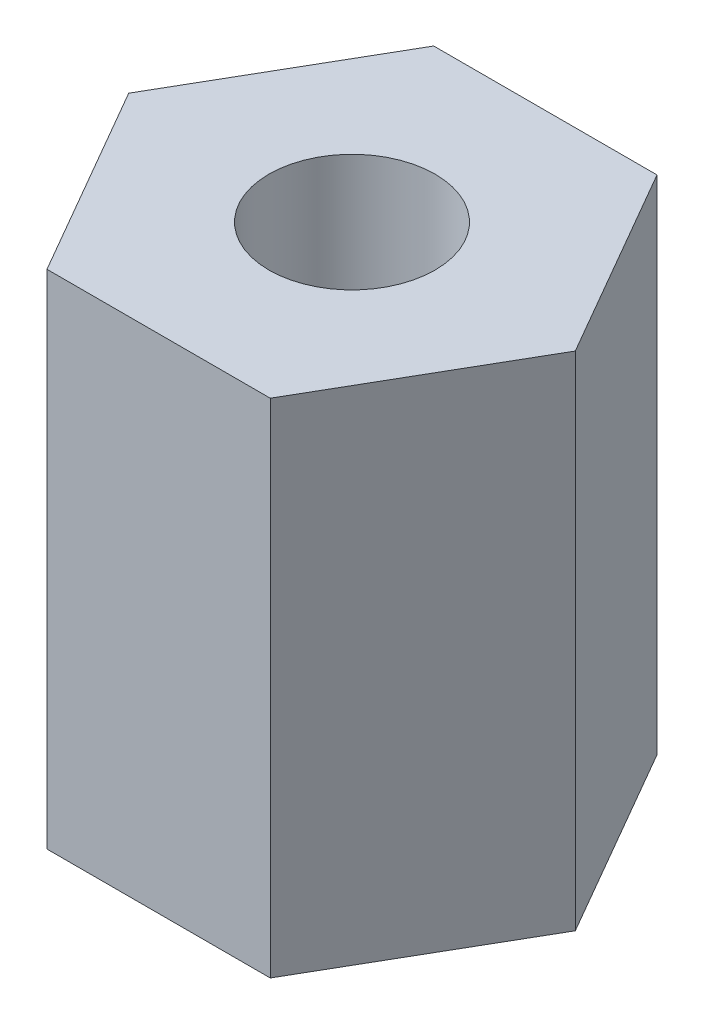
ISO-10303-21;
HEADER;
FILE_DESCRIPTION(('STEP AP214'),'2;1');
FILE_NAME('part.step','',(''),(''),'','','');
FILE_SCHEMA(('AUTOMOTIVE_DESIGN { 1 0 10303 214 1 1 1 1 }'));
ENDSEC;
DATA;
#1=APPLICATION_CONTEXT('core data for automotive mechanical design processes');
#2=APPLICATION_PROTOCOL_DEFINITION('international standard','automotive_design',2000,#1);
#3=PRODUCT_CONTEXT('',#1,'mechanical');
#4=PRODUCT('Part','Part','',(#3));
#5=PRODUCT_RELATED_PRODUCT_CATEGORY('part','',(#4));
#6=PRODUCT_DEFINITION_FORMATION('','',#4);
#7=PRODUCT_DEFINITION_CONTEXT('part definition',#1,'design');
#8=PRODUCT_DEFINITION('design','',#6,#7);
#9=PRODUCT_DEFINITION_SHAPE('','',#8);
#10=(LENGTH_UNIT() NAMED_UNIT(*) SI_UNIT(.MILLI.,.METRE.));
#11=(NAMED_UNIT(*) PLANE_ANGLE_UNIT() SI_UNIT($,.RADIAN.));
#12=(NAMED_UNIT(*) SI_UNIT($,.STERADIAN.) SOLID_ANGLE_UNIT());
#13=UNCERTAINTY_MEASURE_WITH_UNIT(LENGTH_MEASURE(1.E-05),#10,'distance_accuracy_value','');
#14=(GEOMETRIC_REPRESENTATION_CONTEXT(3) GLOBAL_UNCERTAINTY_ASSIGNED_CONTEXT((#13)) GLOBAL_UNIT_ASSIGNED_CONTEXT((#10,
#11,#12)) REPRESENTATION_CONTEXT('',''));
#15=CARTESIAN_POINT('',(0.,0.,0.));
#16=DIRECTION('',(0.,0.,1.));
#17=DIRECTION('',(1.,0.,0.));
#18=AXIS2_PLACEMENT_3D('',#15,#16,#17);
#19=CARTESIAN_POINT('',(1.4675,6.6,-2.54178456010733));
#20=DIRECTION('',(0.,0.,1.));
#21=DIRECTION('',(1.,0.,0.));
#22=AXIS2_PLACEMENT_3D('',#19,#20,#21);
#23=PLANE('',#22);
#24=DIRECTION('',(-1.,0.,0.));
#25=VECTOR('',#24,1.);
#26=CARTESIAN_POINT('',(1.4675,0.,-2.54178456010733));
#27=LINE('',#26,#25);
#28=CARTESIAN_POINT('',(1.4675,0.,-2.54178456010733));
#29=VERTEX_POINT('',#28);
#30=CARTESIAN_POINT('',(-1.4675,0.,-2.54178456010733));
#31=VERTEX_POINT('',#30);
#32=EDGE_CURVE('E130',#29,#31,#27,.T.);
#33=ORIENTED_EDGE('',*,*,#32,.T.);
#34=DIRECTION('',(0.,-1.,0.));
#35=VECTOR('',#34,1.);
#36=CARTESIAN_POINT('',(-1.4675,6.6,-2.54178456010733));
#37=LINE('',#36,#35);
#38=CARTESIAN_POINT('',(-1.4675,6.6,-2.54178456010733));
#39=VERTEX_POINT('',#38);
#40=EDGE_CURVE('E11',#39,#31,#37,.T.);
#41=ORIENTED_EDGE('',*,*,#40,.F.);
#42=DIRECTION('',(-1.,0.,0.));
#43=VECTOR('',#42,1.);
#44=CARTESIAN_POINT('',(1.4675,6.6,-2.54178456010733));
#45=LINE('',#44,#43);
#46=CARTESIAN_POINT('',(1.4675,6.6,-2.54178456010733));
#47=VERTEX_POINT('',#46);
#48=EDGE_CURVE('E147',#47,#39,#45,.T.);
#49=ORIENTED_EDGE('',*,*,#48,.F.);
#50=DIRECTION('',(0.,-1.,0.));
#51=VECTOR('',#50,1.);
#52=CARTESIAN_POINT('',(1.4675,6.6,-2.54178456010733));
#53=LINE('',#52,#51);
#54=EDGE_CURVE('E126',#47,#29,#53,.T.);
#55=ORIENTED_EDGE('',*,*,#54,.T.);
#56=EDGE_LOOP('',(#33,#41,#49,#55));
#57=FACE_BOUND('',#56,.T.);
#58=ADVANCED_FACE('F41',(#57),#23,.F.);
#59=CARTESIAN_POINT('',(-1.4675,6.6,-2.54178456010733));
#60=DIRECTION('',(0.866025403784439,0.,0.5));
#61=DIRECTION('',(0.5,0.,-0.866025403784439));
#62=AXIS2_PLACEMENT_3D('',#59,#60,#61);
#63=PLANE('',#62);
#64=DIRECTION('',(-0.5,0.,0.866025403784439));
#65=VECTOR('',#64,1.);
#66=CARTESIAN_POINT('',(-1.4675,0.,-2.54178456010733));
#67=LINE('',#66,#65);
#68=CARTESIAN_POINT('',(-2.935,0.,0.));
#69=VERTEX_POINT('',#68);
#70=EDGE_CURVE('E134',#31,#69,#67,.T.);
#71=ORIENTED_EDGE('',*,*,#70,.T.);
#72=DIRECTION('',(0.,-1.,0.));
#73=VECTOR('',#72,1.);
#74=CARTESIAN_POINT('',(-2.935,6.6,0.));
#75=LINE('',#74,#73);
#76=CARTESIAN_POINT('',(-2.935,6.6,0.));
#77=VERTEX_POINT('',#76);
#78=EDGE_CURVE('E50',#77,#69,#75,.T.);
#79=ORIENTED_EDGE('',*,*,#78,.F.);
#80=DIRECTION('',(-0.5,0.,0.866025403784439));
#81=VECTOR('',#80,1.);
#82=CARTESIAN_POINT('',(-1.4675,6.6,-2.54178456010733));
#83=LINE('',#82,#81);
#84=EDGE_CURVE('E95',#39,#77,#83,.T.);
#85=ORIENTED_EDGE('',*,*,#84,.F.);
#86=ORIENTED_EDGE('',*,*,#40,.T.);
#87=EDGE_LOOP('',(#71,#79,#85,#86));
#88=FACE_BOUND('',#87,.T.);
#89=ADVANCED_FACE('F176',(#88),#63,.F.);
#90=CARTESIAN_POINT('',(-2.935,6.6,0.));
#91=DIRECTION('',(0.866025403784439,0.,-0.5));
#92=DIRECTION('',(-0.5,0.,-0.866025403784439));
#93=AXIS2_PLACEMENT_3D('',#90,#91,#92);
#94=PLANE('',#93);
#95=DIRECTION('',(0.5,0.,0.866025403784439));
#96=VECTOR('',#95,1.);
#97=CARTESIAN_POINT('',(-2.935,0.,0.));
#98=LINE('',#97,#96);
#99=CARTESIAN_POINT('',(-1.4675,0.,2.54178456010733));
#100=VERTEX_POINT('',#99);
#101=EDGE_CURVE('E138',#69,#100,#98,.T.);
#102=ORIENTED_EDGE('',*,*,#101,.T.);
#103=DIRECTION('',(0.,-1.,0.));
#104=VECTOR('',#103,1.);
#105=CARTESIAN_POINT('',(-1.4675,6.6,2.54178456010733));
#106=LINE('',#105,#104);
#107=CARTESIAN_POINT('',(-1.4675,6.6,2.54178456010733));
#108=VERTEX_POINT('',#107);
#109=EDGE_CURVE('E119',#108,#100,#106,.T.);
#110=ORIENTED_EDGE('',*,*,#109,.F.);
#111=DIRECTION('',(0.5,0.,0.866025403784439));
#112=VECTOR('',#111,1.);
#113=CARTESIAN_POINT('',(-2.935,6.6,0.));
#114=LINE('',#113,#112);
#115=EDGE_CURVE('E108',#77,#108,#114,.T.);
#116=ORIENTED_EDGE('',*,*,#115,.F.);
#117=ORIENTED_EDGE('',*,*,#78,.T.);
#118=EDGE_LOOP('',(#102,#110,#116,#117));
#119=FACE_BOUND('',#118,.T.);
#120=ADVANCED_FACE('F157',(#119),#94,.F.);
#121=CARTESIAN_POINT('',(-1.4675,6.6,2.54178456010733));
#122=DIRECTION('',(0.,0.,-1.));
#123=DIRECTION('',(-1.,0.,0.));
#124=AXIS2_PLACEMENT_3D('',#121,#122,#123);
#125=PLANE('',#124);
#126=DIRECTION('',(1.,0.,0.));
#127=VECTOR('',#126,1.);
#128=CARTESIAN_POINT('',(-1.4675,0.,2.54178456010733));
#129=LINE('',#128,#127);
#130=CARTESIAN_POINT('',(1.4675,0.,2.54178456010733));
#131=VERTEX_POINT('',#130);
#132=EDGE_CURVE('E117',#100,#131,#129,.T.);
#133=ORIENTED_EDGE('',*,*,#132,.T.);
#134=DIRECTION('',(0.,-1.,0.));
#135=VECTOR('',#134,1.);
#136=CARTESIAN_POINT('',(1.4675,6.6,2.54178456010733));
#137=LINE('',#136,#135);
#138=CARTESIAN_POINT('',(1.4675,6.6,2.54178456010733));
#139=VERTEX_POINT('',#138);
#140=EDGE_CURVE('E114',#139,#131,#137,.T.);
#141=ORIENTED_EDGE('',*,*,#140,.F.);
#142=DIRECTION('',(1.,0.,0.));
#143=VECTOR('',#142,1.);
#144=CARTESIAN_POINT('',(-1.4675,6.6,2.54178456010733));
#145=LINE('',#144,#143);
#146=EDGE_CURVE('E102',#108,#139,#145,.T.);
#147=ORIENTED_EDGE('',*,*,#146,.F.);
#148=ORIENTED_EDGE('',*,*,#109,.T.);
#149=EDGE_LOOP('',(#133,#141,#147,#148));
#150=FACE_BOUND('',#149,.T.);
#151=ADVANCED_FACE('F115',(#150),#125,.F.);
#152=CARTESIAN_POINT('',(1.4675,6.6,2.54178456010733));
#153=DIRECTION('',(-0.866025403784439,0.,-0.5));
#154=DIRECTION('',(-0.5,0.,0.866025403784439));
#155=AXIS2_PLACEMENT_3D('',#152,#153,#154);
#156=PLANE('',#155);
#157=DIRECTION('',(0.5,0.,-0.866025403784439));
#158=VECTOR('',#157,1.);
#159=CARTESIAN_POINT('',(1.4675,0.,2.54178456010733));
#160=LINE('',#159,#158);
#161=CARTESIAN_POINT('',(2.935,0.,0.));
#162=VERTEX_POINT('',#161);
#163=EDGE_CURVE('E81',#131,#162,#160,.T.);
#164=ORIENTED_EDGE('',*,*,#163,.T.);
#165=DIRECTION('',(0.,-1.,0.));
#166=VECTOR('',#165,1.);
#167=CARTESIAN_POINT('',(2.935,6.6,0.));
#168=LINE('',#167,#166);
#169=CARTESIAN_POINT('',(2.935,6.6,0.));
#170=VERTEX_POINT('',#169);
#171=EDGE_CURVE('E120',#170,#162,#168,.T.);
#172=ORIENTED_EDGE('',*,*,#171,.F.);
#173=DIRECTION('',(0.5,0.,-0.866025403784439));
#174=VECTOR('',#173,1.);
#175=CARTESIAN_POINT('',(1.4675,6.6,2.54178456010733));
#176=LINE('',#175,#174);
#177=EDGE_CURVE('E106',#139,#170,#176,.T.);
#178=ORIENTED_EDGE('',*,*,#177,.F.);
#179=ORIENTED_EDGE('',*,*,#140,.T.);
#180=EDGE_LOOP('',(#164,#172,#178,#179));
#181=FACE_BOUND('',#180,.T.);
#182=ADVANCED_FACE('F122',(#181),#156,.F.);
#183=CARTESIAN_POINT('',(2.935,6.6,0.));
#184=DIRECTION('',(-0.866025403784439,0.,0.5));
#185=DIRECTION('',(0.5,0.,0.866025403784439));
#186=AXIS2_PLACEMENT_3D('',#183,#184,#185);
#187=PLANE('',#186);
#188=DIRECTION('',(-0.5,0.,-0.866025403784439));
#189=VECTOR('',#188,1.);
#190=CARTESIAN_POINT('',(2.935,0.,0.));
#191=LINE('',#190,#189);
#192=EDGE_CURVE('E87',#162,#29,#191,.T.);
#193=ORIENTED_EDGE('',*,*,#192,.T.);
#194=ORIENTED_EDGE('',*,*,#54,.F.);
#195=DIRECTION('',(-0.5,0.,-0.866025403784439));
#196=VECTOR('',#195,1.);
#197=CARTESIAN_POINT('',(2.935,6.6,0.));
#198=LINE('',#197,#196);
#199=EDGE_CURVE('E58',#170,#47,#198,.T.);
#200=ORIENTED_EDGE('',*,*,#199,.F.);
#201=ORIENTED_EDGE('',*,*,#171,.T.);
#202=EDGE_LOOP('',(#193,#194,#200,#201));
#203=FACE_BOUND('',#202,.T.);
#204=ADVANCED_FACE('F164',(#203),#187,.F.);
#205=CARTESIAN_POINT('',(0.,6.6,0.));
#206=DIRECTION('',(0.,1.,0.));
#207=DIRECTION('',(0.,0.,1.));
#208=AXIS2_PLACEMENT_3D('',#205,#206,#207);
#209=PLANE('',#208);
#210=CARTESIAN_POINT('',(0.,6.6,0.));
#211=DIRECTION('',(0.,-1.,0.));
#212=DIRECTION('',(0.,0.,-1.));
#213=AXIS2_PLACEMENT_3D('',#210,#211,#212);
#214=CIRCLE('',#213,1.0922);
#215=CARTESIAN_POINT('',(0.,6.6,-1.0922));
#216=VERTEX_POINT('',#215);
#217=EDGE_CURVE('E135',#216,#216,#214,.T.);
#218=ORIENTED_EDGE('',*,*,#217,.T.);
#219=EDGE_LOOP('',(#218));
#220=FACE_BOUND('',#219,.T.);
#221=ORIENTED_EDGE('',*,*,#48,.T.);
#222=ORIENTED_EDGE('',*,*,#84,.T.);
#223=ORIENTED_EDGE('',*,*,#115,.T.);
#224=ORIENTED_EDGE('',*,*,#146,.T.);
#225=ORIENTED_EDGE('',*,*,#177,.T.);
#226=ORIENTED_EDGE('',*,*,#199,.T.);
#227=EDGE_LOOP('',(#221,#222,#223,#224,#225,#226));
#228=FACE_BOUND('',#227,.T.);
#229=ADVANCED_FACE('F104',(#220,#228),#209,.T.);
#230=CARTESIAN_POINT('',(0.,0.,0.));
#231=DIRECTION('',(0.,1.,0.));
#232=DIRECTION('',(0.,0.,1.));
#233=AXIS2_PLACEMENT_3D('',#230,#231,#232);
#234=PLANE('',#233);
#235=CARTESIAN_POINT('',(0.,0.,0.));
#236=DIRECTION('',(0.,-1.,0.));
#237=DIRECTION('',(0.,0.,-1.));
#238=AXIS2_PLACEMENT_3D('',#235,#236,#237);
#239=CIRCLE('',#238,1.0922);
#240=CARTESIAN_POINT('',(0.,0.,-1.0922));
#241=VERTEX_POINT('',#240);
#242=EDGE_CURVE('E250',#241,#241,#239,.T.);
#243=ORIENTED_EDGE('',*,*,#242,.F.);
#244=EDGE_LOOP('',(#243));
#245=FACE_BOUND('',#244,.T.);
#246=ORIENTED_EDGE('',*,*,#32,.F.);
#247=ORIENTED_EDGE('',*,*,#192,.F.);
#248=ORIENTED_EDGE('',*,*,#163,.F.);
#249=ORIENTED_EDGE('',*,*,#132,.F.);
#250=ORIENTED_EDGE('',*,*,#101,.F.);
#251=ORIENTED_EDGE('',*,*,#70,.F.);
#252=EDGE_LOOP('',(#246,#247,#248,#249,#250,#251));
#253=FACE_BOUND('',#252,.T.);
#254=ADVANCED_FACE('F160',(#245,#253),#234,.F.);
#255=CARTESIAN_POINT('',(0.,6.6,0.));
#256=DIRECTION('',(0.,-1.,0.));
#257=DIRECTION('',(0.,0.,-1.));
#258=AXIS2_PLACEMENT_3D('',#255,#256,#257);
#259=CYLINDRICAL_SURFACE('',#258,1.0922);
#260=ORIENTED_EDGE('',*,*,#217,.F.);
#261=EDGE_LOOP('',(#260));
#262=FACE_BOUND('',#261,.T.);
#263=ORIENTED_EDGE('',*,*,#242,.T.);
#264=EDGE_LOOP('',(#263));
#265=FACE_BOUND('',#264,.T.);
#266=ADVANCED_FACE('F216',(#262,#265),#259,.F.);
#267=CLOSED_SHELL('',(#58,#89,#120,#151,#182,#204,#229,#254,#266));
#268=MANIFOLD_SOLID_BREP('B2',#267);
#269=ADVANCED_BREP_SHAPE_REPRESENTATION('',(#18,#268),#14);
#270=SHAPE_DEFINITION_REPRESENTATION(#9,#269);
ENDSEC;
END-ISO-10303-21;
